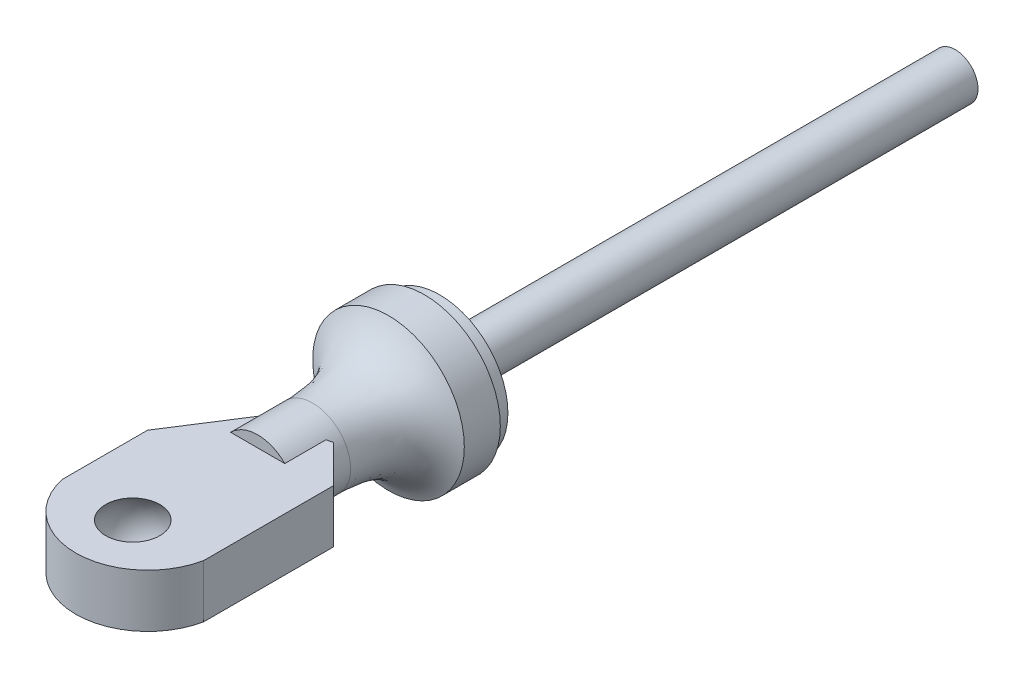
ISO-10303-21;
HEADER;
FILE_DESCRIPTION(('STEP AP214'),'2;1');
FILE_NAME('part.step','',(''),(''),'','','');
FILE_SCHEMA(('AUTOMOTIVE_DESIGN { 1 0 10303 214 1 1 1 1 }'));
ENDSEC;
DATA;
#1=APPLICATION_CONTEXT('core data for automotive mechanical design processes');
#2=APPLICATION_PROTOCOL_DEFINITION('international standard','automotive_design',2000,#1);
#3=PRODUCT_CONTEXT('',#1,'mechanical');
#4=PRODUCT('Part','Part','',(#3));
#5=PRODUCT_RELATED_PRODUCT_CATEGORY('part','',(#4));
#6=PRODUCT_DEFINITION_FORMATION('','',#4);
#7=PRODUCT_DEFINITION_CONTEXT('part definition',#1,'design');
#8=PRODUCT_DEFINITION('design','',#6,#7);
#9=PRODUCT_DEFINITION_SHAPE('','',#8);
#10=(LENGTH_UNIT() NAMED_UNIT(*) SI_UNIT(.MILLI.,.METRE.));
#11=(NAMED_UNIT(*) PLANE_ANGLE_UNIT() SI_UNIT($,.RADIAN.));
#12=(NAMED_UNIT(*) SI_UNIT($,.STERADIAN.) SOLID_ANGLE_UNIT());
#13=UNCERTAINTY_MEASURE_WITH_UNIT(LENGTH_MEASURE(1.E-05),#10,'distance_accuracy_value','');
#14=(GEOMETRIC_REPRESENTATION_CONTEXT(3) GLOBAL_UNCERTAINTY_ASSIGNED_CONTEXT((#13)) GLOBAL_UNIT_ASSIGNED_CONTEXT((#10,
#11,#12)) REPRESENTATION_CONTEXT('',''));
#15=CARTESIAN_POINT('',(0.,0.,0.));
#16=DIRECTION('',(0.,0.,1.));
#17=DIRECTION('',(1.,0.,0.));
#18=AXIS2_PLACEMENT_3D('',#15,#16,#17);
#19=CARTESIAN_POINT('',(-4.64586728176099,1.75,44.6886637869385));
#20=DIRECTION('',(0.213891829961002,0.,0.976857351446942));
#21=DIRECTION('',(0.976857351446942,0.,-0.213891829961002));
#22=AXIS2_PLACEMENT_3D('',#19,#20,#21);
#23=PLANE('',#22);
#24=DIRECTION('',(-0.976857351446942,0.,0.213891829961002));
#25=VECTOR('',#24,1.);
#26=CARTESIAN_POINT('',(-4.64586728176099,1.75,44.6886637869385));
#27=LINE('',#26,#25);
#28=CARTESIAN_POINT('',(2.19053110878381,1.75,43.1917719839233));
#29=VERTEX_POINT('',#28);
#30=CARTESIAN_POINT('',(1.78535710713571,1.75,43.280488528398));
#31=VERTEX_POINT('',#30);
#32=EDGE_CURVE('E113',#29,#31,#27,.T.);
#33=ORIENTED_EDGE('',*,*,#32,.F.);
#34=DIRECTION('',(0.,-1.,0.));
#35=VECTOR('',#34,1.);
#36=CARTESIAN_POINT('',(2.19053110878382,1.75,43.1917719839233));
#37=LINE('',#36,#35);
#38=CARTESIAN_POINT('',(2.19053110878382,1.20481262503775,43.1917719839233));
#39=VERTEX_POINT('',#38);
#40=EDGE_CURVE('E243',#29,#39,#37,.T.);
#41=ORIENTED_EDGE('',*,*,#40,.T.);
#42=CARTESIAN_POINT('',(0.,0.,43.6714087566315));
#43=DIRECTION('',(0.213891829961002,0.,0.976857351446942));
#44=DIRECTION('',(-0.976857351446942,0.,0.213891829961002));
#45=AXIS2_PLACEMENT_3D('',#42,#43,#44);
#46=ELLIPSE('',#45,2.55922729792323,2.5);
#47=EDGE_CURVE('E236',#39,#31,#46,.T.);
#48=ORIENTED_EDGE('',*,*,#47,.T.);
#49=EDGE_LOOP('',(#33,#41,#48));
#50=FACE_BOUND('',#49,.T.);
#51=ADVANCED_FACE('F34',(#50),#23,.F.);
#52=CARTESIAN_POINT('',(0.,2.5,46.));
#53=DIRECTION('',(0.,0.,-1.));
#54=DIRECTION('',(-1.,0.,0.));
#55=AXIS2_PLACEMENT_3D('',#52,#53,#54);
#56=PLANE('',#55);
#57=DIRECTION('',(1.,0.,0.));
#58=VECTOR('',#57,1.);
#59=CARTESIAN_POINT('',(0.,-1.75,46.));
#60=LINE('',#59,#58);
#61=CARTESIAN_POINT('',(-1.78535710713571,-1.75,46.));
#62=VERTEX_POINT('',#61);
#63=CARTESIAN_POINT('',(1.78535710713571,-1.75,46.));
#64=VERTEX_POINT('',#63);
#65=EDGE_CURVE('E265',#62,#64,#60,.T.);
#66=ORIENTED_EDGE('',*,*,#65,.F.);
#67=CARTESIAN_POINT('',(0.,0.,46.));
#68=DIRECTION('',(0.,0.,1.));
#69=DIRECTION('',(1.,0.,0.));
#70=AXIS2_PLACEMENT_3D('',#67,#68,#69);
#71=CIRCLE('',#70,2.5);
#72=EDGE_CURVE('E152',#62,#64,#71,.T.);
#73=ORIENTED_EDGE('',*,*,#72,.T.);
#74=EDGE_LOOP('',(#66,#73));
#75=FACE_BOUND('',#74,.T.);
#76=ADVANCED_FACE('F192',(#75),#56,.F.);
#77=CARTESIAN_POINT('',(0.,0.,34.));
#78=DIRECTION('',(0.,0.,-1.));
#79=DIRECTION('',(-1.,0.,0.));
#80=AXIS2_PLACEMENT_3D('',#77,#78,#79);
#81=CYLINDRICAL_SURFACE('',#80,1.5);
#82=CARTESIAN_POINT('',(0.,0.,34.));
#83=DIRECTION('',(0.,0.,1.));
#84=DIRECTION('',(1.,0.,0.));
#85=AXIS2_PLACEMENT_3D('',#82,#83,#84);
#86=CIRCLE('',#85,1.5);
#87=CARTESIAN_POINT('',(1.5,0.,34.));
#88=VERTEX_POINT('',#87);
#89=EDGE_CURVE('E269',#88,#88,#86,.T.);
#90=ORIENTED_EDGE('',*,*,#89,.F.);
#91=EDGE_LOOP('',(#90));
#92=FACE_BOUND('',#91,.T.);
#93=CARTESIAN_POINT('',(0.,0.,0.));
#94=DIRECTION('',(0.,0.,1.));
#95=DIRECTION('',(1.,0.,0.));
#96=AXIS2_PLACEMENT_3D('',#93,#94,#95);
#97=CIRCLE('',#96,1.5);
#98=CARTESIAN_POINT('',(1.5,0.,0.));
#99=VERTEX_POINT('',#98);
#100=EDGE_CURVE('E272',#99,#99,#97,.T.);
#101=ORIENTED_EDGE('',*,*,#100,.T.);
#102=EDGE_LOOP('',(#101));
#103=FACE_BOUND('',#102,.T.);
#104=ADVANCED_FACE('F189',(#92,#103),#81,.T.);
#105=CARTESIAN_POINT('',(0.,0.,0.));
#106=DIRECTION('',(0.,0.,1.));
#107=DIRECTION('',(1.,0.,0.));
#108=AXIS2_PLACEMENT_3D('',#105,#106,#107);
#109=PLANE('',#108);
#110=ORIENTED_EDGE('',*,*,#100,.F.);
#111=EDGE_LOOP('',(#110));
#112=FACE_BOUND('',#111,.T.);
#113=ADVANCED_FACE('F185',(#112),#109,.F.);
#114=CARTESIAN_POINT('',(0.,0.,34.));
#115=DIRECTION('',(0.,0.,1.));
#116=DIRECTION('',(1.,0.,0.));
#117=AXIS2_PLACEMENT_3D('',#114,#115,#116);
#118=PLANE('',#117);
#119=ORIENTED_EDGE('',*,*,#89,.T.);
#120=EDGE_LOOP('',(#119));
#121=FACE_BOUND('',#120,.T.);
#122=CARTESIAN_POINT('',(0.,0.,34.));
#123=DIRECTION('',(0.,0.,1.));
#124=DIRECTION('',(1.,0.,0.));
#125=AXIS2_PLACEMENT_3D('',#122,#123,#124);
#126=CIRCLE('',#125,4.5);
#127=CARTESIAN_POINT('',(4.5,0.,34.));
#128=VERTEX_POINT('',#127);
#129=EDGE_CURVE('E275',#128,#128,#126,.T.);
#130=ORIENTED_EDGE('',*,*,#129,.F.);
#131=EDGE_LOOP('',(#130));
#132=FACE_BOUND('',#131,.T.);
#133=ADVANCED_FACE('F181',(#121,#132),#118,.F.);
#134=CARTESIAN_POINT('',(0.,0.,46.));
#135=DIRECTION('',(0.,0.,1.));
#136=DIRECTION('',(1.,0.,0.));
#137=AXIS2_PLACEMENT_3D('',#134,#135,#136);
#138=CYLINDRICAL_SURFACE('',#137,4.5);
#139=CARTESIAN_POINT('',(0.,0.,35.));
#140=DIRECTION('',(0.,0.,1.));
#141=DIRECTION('',(1.,0.,0.));
#142=AXIS2_PLACEMENT_3D('',#139,#140,#141);
#143=CIRCLE('',#142,4.5);
#144=CARTESIAN_POINT('',(4.5,0.,35.));
#145=VERTEX_POINT('',#144);
#146=EDGE_CURVE('E280',#145,#145,#143,.T.);
#147=ORIENTED_EDGE('',*,*,#146,.F.);
#148=EDGE_LOOP('',(#147));
#149=FACE_BOUND('',#148,.T.);
#150=ORIENTED_EDGE('',*,*,#129,.T.);
#151=EDGE_LOOP('',(#150));
#152=FACE_BOUND('',#151,.T.);
#153=ADVANCED_FACE('F177',(#149,#152),#138,.T.);
#154=CARTESIAN_POINT('',(0.,4.5,35.));
#155=DIRECTION('',(0.,0.,1.));
#156=DIRECTION('',(1.,0.,0.));
#157=AXIS2_PLACEMENT_3D('',#154,#155,#156);
#158=PLANE('',#157);
#159=CARTESIAN_POINT('',(0.,0.,35.));
#160=DIRECTION('',(0.,0.,1.));
#161=DIRECTION('',(1.,0.,0.));
#162=AXIS2_PLACEMENT_3D('',#159,#160,#161);
#163=CIRCLE('',#162,5.);
#164=CARTESIAN_POINT('',(5.,0.,35.));
#165=VERTEX_POINT('',#164);
#166=EDGE_CURVE('E283',#165,#165,#163,.T.);
#167=ORIENTED_EDGE('',*,*,#166,.F.);
#168=EDGE_LOOP('',(#167));
#169=FACE_BOUND('',#168,.T.);
#170=ORIENTED_EDGE('',*,*,#146,.T.);
#171=EDGE_LOOP('',(#170));
#172=FACE_BOUND('',#171,.T.);
#173=ADVANCED_FACE('F173',(#169,#172),#158,.F.);
#174=CARTESIAN_POINT('',(0.,0.,46.));
#175=DIRECTION('',(0.,0.,1.));
#176=DIRECTION('',(1.,0.,0.));
#177=AXIS2_PLACEMENT_3D('',#174,#175,#176);
#178=CYLINDRICAL_SURFACE('',#177,5.);
#179=CARTESIAN_POINT('',(0.,0.,37.3747415392152));
#180=DIRECTION('',(0.,0.,1.));
#181=DIRECTION('',(1.,0.,0.));
#182=AXIS2_PLACEMENT_3D('',#179,#180,#181);
#183=CIRCLE('',#182,5.);
#184=CARTESIAN_POINT('',(5.,0.,37.3747415392152));
#185=VERTEX_POINT('',#184);
#186=EDGE_CURVE('E286',#185,#185,#183,.T.);
#187=ORIENTED_EDGE('',*,*,#186,.F.);
#188=EDGE_LOOP('',(#187));
#189=FACE_BOUND('',#188,.T.);
#190=ORIENTED_EDGE('',*,*,#166,.T.);
#191=EDGE_LOOP('',(#190));
#192=FACE_BOUND('',#191,.T.);
#193=ADVANCED_FACE('F168',(#189,#192),#178,.T.);
#194=CARTESIAN_POINT('',(0.,5.,37.3747415392152));
#195=CARTESIAN_POINT('',(0.,3.07061686626654,38.2532072442798));
#196=CARTESIAN_POINT('',(0.,2.5,40.0481615030728));
#197=CARTESIAN_POINT('',(0.,2.5,42.3747415392152));
#198=B_SPLINE_CURVE_WITH_KNOTS('',3,(#194,#195,#196,#197),.UNSPECIFIED.,.F.,.F.,(4,4),(0.,1.),.UNSPECIFIED.);
#199=CARTESIAN_POINT('',(0.,0.,46.));
#200=DIRECTION('',(0.,0.,1.));
#201=AXIS1_PLACEMENT('',#199,#200);
#202=SURFACE_OF_REVOLUTION('',#198,#201);
#203=CARTESIAN_POINT('',(0.,0.,42.3747415392152));
#204=DIRECTION('',(0.,0.,1.));
#205=DIRECTION('',(1.,0.,0.));
#206=AXIS2_PLACEMENT_3D('',#203,#204,#205);
#207=CIRCLE('',#206,2.5);
#208=CARTESIAN_POINT('',(2.5,0.,42.3747415392152));
#209=VERTEX_POINT('',#208);
#210=EDGE_CURVE('E288',#209,#209,#207,.T.);
#211=ORIENTED_EDGE('',*,*,#210,.F.);
#212=EDGE_LOOP('',(#211));
#213=FACE_BOUND('',#212,.T.);
#214=ORIENTED_EDGE('',*,*,#186,.T.);
#215=EDGE_LOOP('',(#214));
#216=FACE_BOUND('',#215,.T.);
#217=ADVANCED_FACE('F163',(#213,#216),#202,.T.);
#218=CARTESIAN_POINT('',(0.,0.,46.));
#219=DIRECTION('',(0.,0.,1.));
#220=DIRECTION('',(1.,0.,0.));
#221=AXIS2_PLACEMENT_3D('',#218,#219,#220);
#222=CYLINDRICAL_SURFACE('',#221,2.5);
#223=DIRECTION('',(0.,0.,1.));
#224=VECTOR('',#223,1.);
#225=CARTESIAN_POINT('',(-1.78535710713571,-1.75,46.));
#226=LINE('',#225,#224);
#227=CARTESIAN_POINT('',(-1.78535710713571,-1.75,44.1563328527003));
#228=VERTEX_POINT('',#227);
#229=EDGE_CURVE('E145',#228,#62,#226,.T.);
#230=ORIENTED_EDGE('',*,*,#229,.F.);
#231=CARTESIAN_POINT('',(0.,0.,41.3699520085144));
#232=DIRECTION('',(0.84198682086589,0.,0.539498094054235));
#233=DIRECTION('',(-0.539498094054235,0.,0.84198682086589));
#234=AXIS2_PLACEMENT_3D('',#231,#232,#233);
#235=ELLIPSE('',#234,4.63393666734378,2.5);
#236=CARTESIAN_POINT('',(-1.78535710713571,1.75,44.1563328527003));
#237=VERTEX_POINT('',#236);
#238=EDGE_CURVE('E11',#228,#237,#235,.F.);
#239=ORIENTED_EDGE('',*,*,#238,.T.);
#240=DIRECTION('',(0.,0.,1.));
#241=VECTOR('',#240,1.);
#242=CARTESIAN_POINT('',(-1.78535710713571,1.75,46.));
#243=LINE('',#242,#241);
#244=CARTESIAN_POINT('',(-1.78535710713571,1.75,46.));
#245=VERTEX_POINT('',#244);
#246=EDGE_CURVE('E150',#237,#245,#243,.T.);
#247=ORIENTED_EDGE('',*,*,#246,.T.);
#248=CARTESIAN_POINT('',(1.78535710713571,1.75,46.));
#249=VERTEX_POINT('',#248);
#250=EDGE_CURVE('E157',#249,#245,#71,.T.);
#251=ORIENTED_EDGE('',*,*,#250,.F.);
#252=DIRECTION('',(0.,0.,1.));
#253=VECTOR('',#252,1.);
#254=CARTESIAN_POINT('',(1.78535710713571,1.75,46.));
#255=LINE('',#254,#253);
#256=EDGE_CURVE('E147',#249,#31,#255,.F.);
#257=ORIENTED_EDGE('',*,*,#256,.T.);
#258=ORIENTED_EDGE('',*,*,#47,.F.);
#259=CARTESIAN_POINT('',(0.,0.,41.0012408751395));
#260=DIRECTION('',(-0.707106781186543,0.,0.707106781186552));
#261=DIRECTION('',(0.707106781186552,0.,0.707106781186543));
#262=AXIS2_PLACEMENT_3D('',#259,#260,#261);
#263=ELLIPSE('',#262,3.53553390593272,2.5);
#264=CARTESIAN_POINT('',(2.19053110878382,-1.20481262503775,43.1917719839233));
#265=VERTEX_POINT('',#264);
#266=EDGE_CURVE('E43',#39,#265,#263,.F.);
#267=ORIENTED_EDGE('',*,*,#266,.T.);
#268=CARTESIAN_POINT('',(1.78535710713571,-1.75,43.280488528398));
#269=VERTEX_POINT('',#268);
#270=EDGE_CURVE('E230',#269,#265,#46,.T.);
#271=ORIENTED_EDGE('',*,*,#270,.F.);
#272=DIRECTION('',(0.,0.,1.));
#273=VECTOR('',#272,1.);
#274=CARTESIAN_POINT('',(1.78535710713571,-1.75,46.));
#275=LINE('',#274,#273);
#276=EDGE_CURVE('E122',#64,#269,#275,.F.);
#277=ORIENTED_EDGE('',*,*,#276,.F.);
#278=ORIENTED_EDGE('',*,*,#72,.F.);
#279=EDGE_LOOP('',(#230,#239,#247,#251,#257,#258,#267,#271,#277,#278));
#280=FACE_BOUND('',#279,.T.);
#281=ORIENTED_EDGE('',*,*,#210,.T.);
#282=EDGE_LOOP('',(#281));
#283=FACE_BOUND('',#282,.T.);
#284=ADVANCED_FACE('F167',(#280,#283),#222,.T.);
#285=ORIENTED_EDGE('',*,*,#250,.T.);
#286=DIRECTION('',(1.,0.,0.));
#287=VECTOR('',#286,1.);
#288=CARTESIAN_POINT('',(0.,1.75,46.));
#289=LINE('',#288,#287);
#290=EDGE_CURVE('E264',#245,#249,#289,.T.);
#291=ORIENTED_EDGE('',*,*,#290,.T.);
#292=EDGE_LOOP('',(#285,#291));
#293=FACE_BOUND('',#292,.T.);
#294=ADVANCED_FACE('F215',(#293),#56,.F.);
#295=ORIENTED_EDGE('',*,*,#270,.T.);
#296=DIRECTION('',(0.,-1.,0.));
#297=VECTOR('',#296,1.);
#298=CARTESIAN_POINT('',(2.19053110878382,1.75,43.1917719839233));
#299=LINE('',#298,#297);
#300=CARTESIAN_POINT('',(2.19053110878381,-1.75,43.1917719839233));
#301=VERTEX_POINT('',#300);
#302=EDGE_CURVE('E232',#265,#301,#299,.T.);
#303=ORIENTED_EDGE('',*,*,#302,.T.);
#304=DIRECTION('',(-0.976857351446942,0.,0.213891829961002));
#305=VECTOR('',#304,1.);
#306=CARTESIAN_POINT('',(-4.64586728176099,-1.75,44.6886637869385));
#307=LINE('',#306,#305);
#308=EDGE_CURVE('E133',#301,#269,#307,.T.);
#309=ORIENTED_EDGE('',*,*,#308,.T.);
#310=EDGE_LOOP('',(#295,#303,#309));
#311=FACE_BOUND('',#310,.T.);
#312=ADVANCED_FACE('F210',(#311),#23,.F.);
#313=CARTESIAN_POINT('',(0.,1.75,53.2500208502291));
#314=DIRECTION('',(0.,1.,0.));
#315=DIRECTION('',(0.,0.,1.));
#316=AXIS2_PLACEMENT_3D('',#313,#314,#315);
#317=PLANE('',#316);
#318=CARTESIAN_POINT('',(0.,1.75,54.2391705862463));
#319=DIRECTION('',(0.,-1.,0.));
#320=DIRECTION('',(0.,0.,-1.));
#321=AXIS2_PLACEMENT_3D('',#318,#319,#320);
#322=CIRCLE('',#321,1.78535710713571);
#323=CARTESIAN_POINT('',(0.,1.75,56.024527693382));
#324=VERTEX_POINT('',#323);
#325=EDGE_CURVE('E299',#324,#324,#322,.T.);
#326=ORIENTED_EDGE('',*,*,#325,.T.);
#327=EDGE_LOOP('',(#326));
#328=FACE_BOUND('',#327,.T.);
#329=DIRECTION('',(0.,0.,-1.));
#330=VECTOR('',#329,1.);
#331=CARTESIAN_POINT('',(4.65164727001918,1.75,42.6528881451586));
#332=LINE('',#331,#330);
#333=CARTESIAN_POINT('',(4.65164727001918,1.75,54.2116224700921));
#334=VERTEX_POINT('',#333);
#335=CARTESIAN_POINT('',(4.65164727001918,1.75,45.6528881451586));
#336=VERTEX_POINT('',#335);
#337=EDGE_CURVE('E128',#334,#336,#332,.T.);
#338=ORIENTED_EDGE('',*,*,#337,.T.);
#339=DIRECTION('',(0.707106781186552,0.,0.707106781186543));
#340=VECTOR('',#339,1.);
#341=CARTESIAN_POINT('',(6.12438998754482,1.75,47.1256308626842));
#342=LINE('',#341,#340);
#343=EDGE_CURVE('E255',#336,#29,#342,.F.);
#344=ORIENTED_EDGE('',*,*,#343,.T.);
#345=ORIENTED_EDGE('',*,*,#32,.T.);
#346=ORIENTED_EDGE('',*,*,#256,.F.);
#347=ORIENTED_EDGE('',*,*,#290,.F.);
#348=ORIENTED_EDGE('',*,*,#246,.F.);
#349=DIRECTION('',(0.539498094054235,0.,-0.84198682086589));
#350=VECTOR('',#349,1.);
#351=CARTESIAN_POINT('',(-5.3965246580706,1.75,49.7922294746448));
#352=LINE('',#351,#350);
#353=CARTESIAN_POINT('',(-4.64586728176099,1.75,48.6206894362199));
#354=VERTEX_POINT('',#353);
#355=EDGE_CURVE('E50',#237,#354,#352,.F.);
#356=ORIENTED_EDGE('',*,*,#355,.T.);
#357=DIRECTION('',(0.,0.,1.));
#358=VECTOR('',#357,1.);
#359=CARTESIAN_POINT('',(-4.64586728176099,1.75,44.6886637869385));
#360=LINE('',#359,#358);
#361=CARTESIAN_POINT('',(-4.64586728176099,1.75,54.2391705862463));
#362=VERTEX_POINT('',#361);
#363=EDGE_CURVE('E103',#354,#362,#360,.T.);
#364=ORIENTED_EDGE('',*,*,#363,.T.);
#365=CARTESIAN_POINT('',(0.,1.75,53.2500208502291));
#366=DIRECTION('',(0.,1.,0.));
#367=DIRECTION('',(0.,0.,1.));
#368=AXIS2_PLACEMENT_3D('',#365,#366,#367);
#369=CIRCLE('',#368,4.75);
#370=EDGE_CURVE('E108',#362,#334,#369,.T.);
#371=ORIENTED_EDGE('',*,*,#370,.T.);
#372=EDGE_LOOP('',(#338,#344,#345,#346,#347,#348,#356,#364,#371));
#373=FACE_BOUND('',#372,.T.);
#374=ADVANCED_FACE('F106',(#328,#373),#317,.T.);
#375=CARTESIAN_POINT('',(0.,-1.75,53.2500208502291));
#376=DIRECTION('',(0.,1.,0.));
#377=DIRECTION('',(0.,0.,1.));
#378=AXIS2_PLACEMENT_3D('',#375,#376,#377);
#379=PLANE('',#378);
#380=CARTESIAN_POINT('',(0.,-1.75,54.2391705862463));
#381=DIRECTION('',(0.,-1.,0.));
#382=DIRECTION('',(0.,0.,-1.));
#383=AXIS2_PLACEMENT_3D('',#380,#381,#382);
#384=CIRCLE('',#383,1.78535710713571);
#385=CARTESIAN_POINT('',(0.,-1.75,56.024527693382));
#386=VERTEX_POINT('',#385);
#387=EDGE_CURVE('E135',#386,#386,#384,.T.);
#388=ORIENTED_EDGE('',*,*,#387,.F.);
#389=EDGE_LOOP('',(#388));
#390=FACE_BOUND('',#389,.T.);
#391=ORIENTED_EDGE('',*,*,#308,.F.);
#392=DIRECTION('',(-0.707106781186552,0.,-0.707106781186543));
#393=VECTOR('',#392,1.);
#394=CARTESIAN_POINT('',(2.19053110878381,-1.75,43.1917719839233));
#395=LINE('',#394,#393);
#396=CARTESIAN_POINT('',(4.65164727001918,-1.75,45.6528881451586));
#397=VERTEX_POINT('',#396);
#398=EDGE_CURVE('E242',#301,#397,#395,.F.);
#399=ORIENTED_EDGE('',*,*,#398,.T.);
#400=DIRECTION('',(0.,0.,-1.));
#401=VECTOR('',#400,1.);
#402=CARTESIAN_POINT('',(4.65164727001918,-1.75,42.6528881451586));
#403=LINE('',#402,#401);
#404=CARTESIAN_POINT('',(4.65164727001918,-1.75,54.2116224700921));
#405=VERTEX_POINT('',#404);
#406=EDGE_CURVE('E139',#405,#397,#403,.T.);
#407=ORIENTED_EDGE('',*,*,#406,.F.);
#408=CARTESIAN_POINT('',(0.,-1.75,53.2500208502291));
#409=DIRECTION('',(0.,1.,0.));
#410=DIRECTION('',(0.,0.,1.));
#411=AXIS2_PLACEMENT_3D('',#408,#409,#410);
#412=CIRCLE('',#411,4.75);
#413=CARTESIAN_POINT('',(-4.64586728176099,-1.75,54.2391705862463));
#414=VERTEX_POINT('',#413);
#415=EDGE_CURVE('E137',#414,#405,#412,.T.);
#416=ORIENTED_EDGE('',*,*,#415,.F.);
#417=DIRECTION('',(0.,0.,1.));
#418=VECTOR('',#417,1.);
#419=CARTESIAN_POINT('',(-4.64586728176099,-1.75,44.6886637869385));
#420=LINE('',#419,#418);
#421=CARTESIAN_POINT('',(-4.64586728176099,-1.75,48.6206894362199));
#422=VERTEX_POINT('',#421);
#423=EDGE_CURVE('E119',#422,#414,#420,.T.);
#424=ORIENTED_EDGE('',*,*,#423,.F.);
#425=DIRECTION('',(-0.539498094054235,0.,0.84198682086589));
#426=VECTOR('',#425,1.);
#427=CARTESIAN_POINT('',(-4.64586728176099,-1.75,48.6206894362199));
#428=LINE('',#427,#426);
#429=EDGE_CURVE('E245',#422,#228,#428,.F.);
#430=ORIENTED_EDGE('',*,*,#429,.T.);
#431=ORIENTED_EDGE('',*,*,#229,.T.);
#432=ORIENTED_EDGE('',*,*,#65,.T.);
#433=ORIENTED_EDGE('',*,*,#276,.T.);
#434=EDGE_LOOP('',(#391,#399,#407,#416,#424,#430,#431,#432,#433));
#435=FACE_BOUND('',#434,.T.);
#436=ADVANCED_FACE('F224',(#390,#435),#379,.F.);
#437=CARTESIAN_POINT('',(-4.64586728176099,1.75,44.6886637869385));
#438=DIRECTION('',(1.,0.,0.));
#439=DIRECTION('',(0.,0.,-1.));
#440=AXIS2_PLACEMENT_3D('',#437,#438,#439);
#441=PLANE('',#440);
#442=ORIENTED_EDGE('',*,*,#363,.F.);
#443=DIRECTION('',(0.,-1.,0.));
#444=VECTOR('',#443,1.);
#445=CARTESIAN_POINT('',(-4.64586728176099,1.75,48.6206894362199));
#446=LINE('',#445,#444);
#447=EDGE_CURVE('E257',#354,#422,#446,.T.);
#448=ORIENTED_EDGE('',*,*,#447,.T.);
#449=ORIENTED_EDGE('',*,*,#423,.T.);
#450=DIRECTION('',(0.,-1.,0.));
#451=VECTOR('',#450,1.);
#452=CARTESIAN_POINT('',(-4.64586728176099,1.75,54.2391705862463));
#453=LINE('',#452,#451);
#454=EDGE_CURVE('E116',#362,#414,#453,.T.);
#455=ORIENTED_EDGE('',*,*,#454,.F.);
#456=EDGE_LOOP('',(#442,#448,#449,#455));
#457=FACE_BOUND('',#456,.T.);
#458=ADVANCED_FACE('F117',(#457),#441,.F.);
#459=CARTESIAN_POINT('',(0.,1.75,53.2500208502291));
#460=DIRECTION('',(0.,-1.,0.));
#461=DIRECTION('',(0.,0.,-1.));
#462=AXIS2_PLACEMENT_3D('',#459,#460,#461);
#463=CYLINDRICAL_SURFACE('',#462,4.75);
#464=ORIENTED_EDGE('',*,*,#415,.T.);
#465=DIRECTION('',(0.,-1.,0.));
#466=VECTOR('',#465,1.);
#467=CARTESIAN_POINT('',(4.65164727001918,1.75,54.2116224700921));
#468=LINE('',#467,#466);
#469=EDGE_CURVE('E123',#334,#405,#468,.T.);
#470=ORIENTED_EDGE('',*,*,#469,.F.);
#471=ORIENTED_EDGE('',*,*,#370,.F.);
#472=ORIENTED_EDGE('',*,*,#454,.T.);
#473=EDGE_LOOP('',(#464,#470,#471,#472));
#474=FACE_BOUND('',#473,.T.);
#475=ADVANCED_FACE('F125',(#474),#463,.T.);
#476=CARTESIAN_POINT('',(4.65164727001918,1.75,42.6528881451586));
#477=DIRECTION('',(-1.,0.,0.));
#478=DIRECTION('',(0.,0.,1.));
#479=AXIS2_PLACEMENT_3D('',#476,#477,#478);
#480=PLANE('',#479);
#481=ORIENTED_EDGE('',*,*,#406,.T.);
#482=DIRECTION('',(0.,1.,0.));
#483=VECTOR('',#482,1.);
#484=CARTESIAN_POINT('',(4.65164727001918,1.75,45.6528881451586));
#485=LINE('',#484,#483);
#486=EDGE_CURVE('E252',#397,#336,#485,.T.);
#487=ORIENTED_EDGE('',*,*,#486,.T.);
#488=ORIENTED_EDGE('',*,*,#337,.F.);
#489=ORIENTED_EDGE('',*,*,#469,.T.);
#490=EDGE_LOOP('',(#481,#487,#488,#489));
#491=FACE_BOUND('',#490,.T.);
#492=ADVANCED_FACE('F196',(#491),#480,.F.);
#493=CARTESIAN_POINT('',(2.19053110878381,1.75,43.1917719839233));
#494=DIRECTION('',(-0.707106781186543,0.,0.707106781186552));
#495=DIRECTION('',(0.,-1.,0.));
#496=AXIS2_PLACEMENT_3D('',#493,#494,#495);
#497=PLANE('',#496);
#498=ORIENTED_EDGE('',*,*,#343,.F.);
#499=ORIENTED_EDGE('',*,*,#486,.F.);
#500=ORIENTED_EDGE('',*,*,#398,.F.);
#501=ORIENTED_EDGE('',*,*,#302,.F.);
#502=ORIENTED_EDGE('',*,*,#266,.F.);
#503=ORIENTED_EDGE('',*,*,#40,.F.);
#504=EDGE_LOOP('',(#498,#499,#500,#501,#502,#503));
#505=FACE_BOUND('',#504,.T.);
#506=ADVANCED_FACE('F194',(#505),#497,.F.);
#507=CARTESIAN_POINT('',(-4.64586728176099,1.75,48.6206894362199));
#508=DIRECTION('',(0.84198682086589,0.,0.539498094054235));
#509=DIRECTION('',(0.,-1.,0.));
#510=AXIS2_PLACEMENT_3D('',#507,#508,#509);
#511=PLANE('',#510);
#512=ORIENTED_EDGE('',*,*,#355,.F.);
#513=ORIENTED_EDGE('',*,*,#238,.F.);
#514=ORIENTED_EDGE('',*,*,#429,.F.);
#515=ORIENTED_EDGE('',*,*,#447,.F.);
#516=EDGE_LOOP('',(#512,#513,#514,#515));
#517=FACE_BOUND('',#516,.T.);
#518=ADVANCED_FACE('F36',(#517),#511,.F.);
#519=CARTESIAN_POINT('',(0.,0.,54.2391705862463));
#520=DIRECTION('',(0.,-1.,0.));
#521=DIRECTION('',(0.,0.,1.));
#522=AXIS2_PLACEMENT_3D('',#519,#520,#521);
#523=SPHERICAL_SURFACE('',#522,2.5);
#524=CARTESIAN_POINT('',(0.,-1.75,56.024527693382));
#525=CARTESIAN_POINT('',(0.,-1.72115968624752,56.052798009632));
#526=CARTESIAN_POINT('',(0.,-1.69163328038948,56.080368272997));
#527=CARTESIAN_POINT('',(0.,-1.63128002488736,56.134046662902));
#528=CARTESIAN_POINT('',(0.,-1.60045317524327,56.1601547894421));
#529=CARTESIAN_POINT('',(0.,-1.53757077259413,56.2108468746422));
#530=CARTESIAN_POINT('',(0.,-1.50551521958907,56.2354308333022));
#531=CARTESIAN_POINT('',(0.,-1.44025085402525,56.2830170505957));
#532=CARTESIAN_POINT('',(0.,-1.4070420414665,56.3060193092291));
#533=CARTESIAN_POINT('',(0.,-1.33954908937621,56.3503880618745));
#534=CARTESIAN_POINT('',(0.,-1.30526494984466,56.3717545558864));
#535=CARTESIAN_POINT('',(0.,-1.23570186015226,56.4128016217463));
#536=CARTESIAN_POINT('',(0.,-1.2004229099914,56.4324821935942));
#537=CARTESIAN_POINT('',(0.,-1.12895303559685,56.4701111986655));
#538=CARTESIAN_POINT('',(0.,-1.09276211136316,56.4880596318888));
#539=CARTESIAN_POINT('',(0.,-1.01955327103915,56.5221822152949));
#540=CARTESIAN_POINT('',(0.,-0.982535354948837,56.5383563654776));
#541=CARTESIAN_POINT('',(0.,-0.907759453889573,56.5688924033792));
#542=CARTESIAN_POINT('',(0.,-0.870001468920625,56.583254291098));
#543=CARTESIAN_POINT('',(0.,-0.793834091169595,56.6101320804334));
#544=CARTESIAN_POINT('',(0.,-0.755424698387514,56.6226479820499));
#545=CARTESIAN_POINT('',(0.,-0.678044695590741,56.6458044100833));
#546=CARTESIAN_POINT('',(0.,-0.63907408557605,56.6564449365001));
#547=CARTESIAN_POINT('',(0.,-0.560663156732463,56.6758256287028));
#548=CARTESIAN_POINT('',(0.,-0.521222837903567,56.6845657944888));
#549=CARTESIAN_POINT('',(0.,-0.441965102785789,56.7001252423032));
#550=CARTESIAN_POINT('',(0.,-0.402147686496906,56.7069445243316));
#551=CARTESIAN_POINT('',(0.,-0.322229253292232,56.7186461920086));
#552=CARTESIAN_POINT('',(0.,-0.282128236376439,56.7235285776572));
#553=CARTESIAN_POINT('',(0.,-0.201736764684329,56.7313449880534));
#554=CARTESIAN_POINT('',(0.,-0.161446309908011,56.7342790128011));
#555=CARTESIAN_POINT('',(0.,-0.0807705700877952,56.7381918118976));
#556=CARTESIAN_POINT('',(0.,-0.0403852850438978,56.7391705862463));
#557=CARTESIAN_POINT('',(0.,0.0403852850438972,56.7391705862463));
#558=CARTESIAN_POINT('',(0.,0.0807705700877947,56.7381918118976));
#559=CARTESIAN_POINT('',(0.,0.16144630990801,56.7342790128011));
#560=CARTESIAN_POINT('',(0.,0.201736764684328,56.7313449880534));
#561=CARTESIAN_POINT('',(0.,0.282128236376438,56.7235285776572));
#562=CARTESIAN_POINT('',(0.,0.322229253292231,56.7186461920086));
#563=CARTESIAN_POINT('',(0.,0.402147686496906,56.7069445243316));
#564=CARTESIAN_POINT('',(0.,0.441965102785788,56.7001252423032));
#565=CARTESIAN_POINT('',(0.,0.521222837903566,56.6845657944888));
#566=CARTESIAN_POINT('',(0.,0.560663156732462,56.6758256287028));
#567=CARTESIAN_POINT('',(0.,0.639074085576049,56.6564449365001));
#568=CARTESIAN_POINT('',(0.,0.678044695590741,56.6458044100833));
#569=CARTESIAN_POINT('',(0.,0.755424698387513,56.6226479820499));
#570=CARTESIAN_POINT('',(0.,0.793834091169595,56.6101320804334));
#571=CARTESIAN_POINT('',(0.,0.870001468920624,56.583254291098));
#572=CARTESIAN_POINT('',(0.,0.907759453889573,56.5688924033792));
#573=CARTESIAN_POINT('',(0.,0.982535354948837,56.5383563654776));
#574=CARTESIAN_POINT('',(0.,1.01955327103915,56.5221822152949));
#575=CARTESIAN_POINT('',(0.,1.09276211136316,56.4880596318888));
#576=CARTESIAN_POINT('',(0.,1.12895303559685,56.4701111986655));
#577=CARTESIAN_POINT('',(0.,1.2004229099914,56.4324821935942));
#578=CARTESIAN_POINT('',(0.,1.23570186015226,56.4128016217463));
#579=CARTESIAN_POINT('',(0.,1.30526494984466,56.3717545558864));
#580=CARTESIAN_POINT('',(0.,1.33954908937621,56.3503880618745));
#581=CARTESIAN_POINT('',(0.,1.4070420414665,56.3060193092291));
#582=CARTESIAN_POINT('',(0.,1.44025085402525,56.2830170505957));
#583=CARTESIAN_POINT('',(0.,1.50551521958907,56.2354308333022));
#584=CARTESIAN_POINT('',(0.,1.53757077259413,56.2108468746422));
#585=CARTESIAN_POINT('',(0.,1.60045317524327,56.1601547894421));
#586=CARTESIAN_POINT('',(0.,1.63128002488735,56.134046662902));
#587=CARTESIAN_POINT('',(0.,1.69163328038948,56.080368272997));
#588=CARTESIAN_POINT('',(0.,1.72115968624752,56.052798009632));
#589=CARTESIAN_POINT('',(0.,1.75,56.024527693382));
#590=B_SPLINE_CURVE_WITH_KNOTS('',3,(#524,#525,#526,#527,#528,#529,#530,#531,#532,#533,#534,
#535,#536,#537,#538,#539,#540,#541,#542,#543,#544,#545,#546,#547,#548,#549,#550,#551,#552,#553,
#554,#555,#556,#557,#558,#559,#560,#561,#562,#563,#564,#565,#566,#567,#568,#569,#570,#571,#572,
#573,#574,#575,#576,#577,#578,#579,#580,#581,#582,#583,#584,#585,#586,#587,#588,#589),
.UNSPECIFIED.,.F.,.F.,(4,2,2,2,2,2,2,2,2,2,2,2,2,2,2,2,2,2,2,2,2,2,2,2,2,2,2,2,2,2,2,2,4),(0.,
0.121144003089425,0.24228800617885,0.363432009268278,0.484576012357702,0.605720015447127,
0.72686401853655,0.848008021625975,0.969152024715401,1.09029602780483,1.21144003089425,
1.33258403398368,1.4537280370731,1.57487204016253,1.69601604325195,1.81716004634138,
1.9383040494308,2.05944805252023,2.18059205560965,2.30173605869908,2.4228800617885,
2.54402406487793,2.66516806796735,2.78631207105678,2.9074560741462,3.02860007723563,
3.14974408032505,3.27088808341448,3.3920320865039,3.51317608959333,3.63432009268275,
3.75546409577218,3.8766080988616),.UNSPECIFIED.);
#591=EDGE_CURVE('BSEAM202',#386,#324,#590,.T.);
#592=ORIENTED_EDGE('',*,*,#387,.T.);
#593=ORIENTED_EDGE('',*,*,#325,.F.);
#594=ORIENTED_EDGE('',*,*,#591,.T.);
#595=ORIENTED_EDGE('',*,*,#591,.F.);
#596=EDGE_LOOP('',(#592,#594,#593,#595));
#597=FACE_BOUND('',#596,.T.);
#598=ADVANCED_FACE('F202',(#597),#523,.F.);
#599=CLOSED_SHELL('',(#51,#76,#104,#113,#133,#153,#173,#193,#217,#284,#294,#312,#374,#436,#458,
#475,#492,#506,#518,#598));
#600=MANIFOLD_SOLID_BREP('B2',#599);
#601=ADVANCED_BREP_SHAPE_REPRESENTATION('',(#18,#600),#14);
#602=SHAPE_DEFINITION_REPRESENTATION(#9,#601);
ENDSEC;
END-ISO-10303-21;
